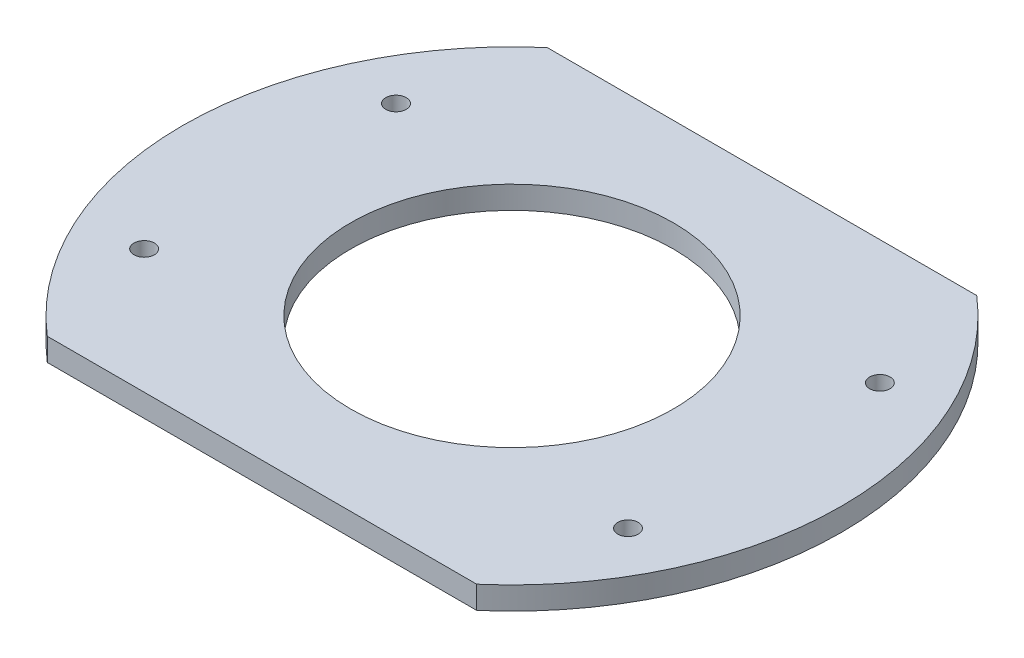
ISO-10303-21;
HEADER;
FILE_DESCRIPTION(('STEP AP214'),'2;1');
FILE_NAME('part.step','',(''),(''),'','','');
FILE_SCHEMA(('AUTOMOTIVE_DESIGN { 1 0 10303 214 1 1 1 1 }'));
ENDSEC;
DATA;
#1=APPLICATION_CONTEXT('core data for automotive mechanical design processes');
#2=APPLICATION_PROTOCOL_DEFINITION('international standard','automotive_design',2000,#1);
#3=PRODUCT_CONTEXT('',#1,'mechanical');
#4=PRODUCT('Part','Part','',(#3));
#5=PRODUCT_RELATED_PRODUCT_CATEGORY('part','',(#4));
#6=PRODUCT_DEFINITION_FORMATION('','',#4);
#7=PRODUCT_DEFINITION_CONTEXT('part definition',#1,'design');
#8=PRODUCT_DEFINITION('design','',#6,#7);
#9=PRODUCT_DEFINITION_SHAPE('','',#8);
#10=(LENGTH_UNIT() NAMED_UNIT(*) SI_UNIT(.MILLI.,.METRE.));
#11=(NAMED_UNIT(*) PLANE_ANGLE_UNIT() SI_UNIT($,.RADIAN.));
#12=(NAMED_UNIT(*) SI_UNIT($,.STERADIAN.) SOLID_ANGLE_UNIT());
#13=UNCERTAINTY_MEASURE_WITH_UNIT(LENGTH_MEASURE(1.E-05),#10,'distance_accuracy_value','');
#14=(GEOMETRIC_REPRESENTATION_CONTEXT(3) GLOBAL_UNCERTAINTY_ASSIGNED_CONTEXT((#13)) GLOBAL_UNIT_ASSIGNED_CONTEXT((#10,
#11,#12)) REPRESENTATION_CONTEXT('',''));
#15=CARTESIAN_POINT('',(0.,0.,0.));
#16=DIRECTION('',(0.,0.,1.));
#17=DIRECTION('',(1.,0.,0.));
#18=AXIS2_PLACEMENT_3D('',#15,#16,#17);
#19=CARTESIAN_POINT('',(0.,5.,0.));
#20=DIRECTION('',(0.,1.,0.));
#21=DIRECTION('',(0.,0.,1.));
#22=AXIS2_PLACEMENT_3D('',#19,#20,#21);
#23=PLANE('',#22);
#24=CARTESIAN_POINT('',(-53.2206499906933,5.,27.7049167941021));
#25=DIRECTION('',(0.,1.,0.));
#26=DIRECTION('',(0.,0.,1.));
#27=AXIS2_PLACEMENT_3D('',#24,#25,#26);
#28=CIRCLE('',#27,2.25);
#29=CARTESIAN_POINT('',(-53.2206499906933,5.,29.9549167941021));
#30=VERTEX_POINT('',#29);
#31=EDGE_CURVE('E155',#30,#30,#28,.T.);
#32=ORIENTED_EDGE('',*,*,#31,.F.);
#33=EDGE_LOOP('',(#32));
#34=FACE_BOUND('',#33,.T.);
#35=CARTESIAN_POINT('',(53.2206499906933,5.,-27.7049167941021));
#36=DIRECTION('',(0.,1.,0.));
#37=DIRECTION('',(0.,0.,1.));
#38=AXIS2_PLACEMENT_3D('',#35,#36,#37);
#39=CIRCLE('',#38,2.25);
#40=CARTESIAN_POINT('',(53.2206499906933,5.,-25.4549167941022));
#41=VERTEX_POINT('',#40);
#42=EDGE_CURVE('E139',#41,#41,#39,.T.);
#43=ORIENTED_EDGE('',*,*,#42,.F.);
#44=EDGE_LOOP('',(#43));
#45=FACE_BOUND('',#44,.T.);
#46=CARTESIAN_POINT('',(0.,5.,0.));
#47=DIRECTION('',(0.,1.,0.));
#48=DIRECTION('',(0.,0.,1.));
#49=AXIS2_PLACEMENT_3D('',#46,#47,#48);
#50=CIRCLE('',#49,72.5);
#51=CARTESIAN_POINT('',(-47.236109069228,5.,-55.));
#52=VERTEX_POINT('',#51);
#53=CARTESIAN_POINT('',(-47.236109069228,5.,55.));
#54=VERTEX_POINT('',#53);
#55=EDGE_CURVE('E94',#52,#54,#50,.T.);
#56=ORIENTED_EDGE('',*,*,#55,.T.);
#57=DIRECTION('',(1.,0.,0.));
#58=VECTOR('',#57,1.);
#59=CARTESIAN_POINT('',(-47.236109069228,5.,55.));
#60=LINE('',#59,#58);
#61=CARTESIAN_POINT('',(47.236109069228,5.,55.));
#62=VERTEX_POINT('',#61);
#63=EDGE_CURVE('E89',#54,#62,#60,.T.);
#64=ORIENTED_EDGE('',*,*,#63,.T.);
#65=CARTESIAN_POINT('',(0.,5.,0.));
#66=DIRECTION('',(0.,1.,0.));
#67=DIRECTION('',(0.,0.,1.));
#68=AXIS2_PLACEMENT_3D('',#65,#66,#67);
#69=CIRCLE('',#68,72.5);
#70=CARTESIAN_POINT('',(47.2361090692279,5.,-55.));
#71=VERTEX_POINT('',#70);
#72=EDGE_CURVE('E92',#62,#71,#69,.T.);
#73=ORIENTED_EDGE('',*,*,#72,.T.);
#74=DIRECTION('',(-1.,0.,0.));
#75=VECTOR('',#74,1.);
#76=CARTESIAN_POINT('',(-47.236109069228,5.,-55.));
#77=LINE('',#76,#75);
#78=EDGE_CURVE('E59',#71,#52,#77,.T.);
#79=ORIENTED_EDGE('',*,*,#78,.T.);
#80=EDGE_LOOP('',(#56,#64,#73,#79));
#81=FACE_BOUND('',#80,.T.);
#82=CARTESIAN_POINT('',(0.,5.,0.));
#83=DIRECTION('',(0.,1.,0.));
#84=DIRECTION('',(0.,0.,1.));
#85=AXIS2_PLACEMENT_3D('',#82,#83,#84);
#86=CIRCLE('',#85,35.5);
#87=CARTESIAN_POINT('',(0.,5.,35.5));
#88=VERTEX_POINT('',#87);
#89=EDGE_CURVE('E115',#88,#88,#86,.T.);
#90=ORIENTED_EDGE('',*,*,#89,.F.);
#91=EDGE_LOOP('',(#90));
#92=FACE_BOUND('',#91,.T.);
#93=CARTESIAN_POINT('',(53.2206499906933,5.,27.7049167941021));
#94=DIRECTION('',(0.,1.,0.));
#95=DIRECTION('',(0.,0.,1.));
#96=AXIS2_PLACEMENT_3D('',#93,#94,#95);
#97=CIRCLE('',#96,2.25);
#98=CARTESIAN_POINT('',(53.2206499906933,5.,29.9549167941021));
#99=VERTEX_POINT('',#98);
#100=EDGE_CURVE('E147',#99,#99,#97,.T.);
#101=ORIENTED_EDGE('',*,*,#100,.F.);
#102=EDGE_LOOP('',(#101));
#103=FACE_BOUND('',#102,.T.);
#104=CARTESIAN_POINT('',(-53.2206499906933,5.,-27.7049167941021));
#105=DIRECTION('',(0.,1.,0.));
#106=DIRECTION('',(0.,0.,1.));
#107=AXIS2_PLACEMENT_3D('',#104,#105,#106);
#108=CIRCLE('',#107,2.25);
#109=CARTESIAN_POINT('',(-53.2206499906933,5.,-25.4549167941021));
#110=VERTEX_POINT('',#109);
#111=EDGE_CURVE('E163',#110,#110,#108,.T.);
#112=ORIENTED_EDGE('',*,*,#111,.F.);
#113=EDGE_LOOP('',(#112));
#114=FACE_BOUND('',#113,.T.);
#115=ADVANCED_FACE('F41',(#34,#45,#81,#92,#103,#114),#23,.T.);
#116=CARTESIAN_POINT('',(0.,0.,0.));
#117=DIRECTION('',(0.,1.,0.));
#118=DIRECTION('',(0.,0.,1.));
#119=AXIS2_PLACEMENT_3D('',#116,#117,#118);
#120=PLANE('',#119);
#121=CARTESIAN_POINT('',(0.,0.,0.));
#122=DIRECTION('',(0.,1.,0.));
#123=DIRECTION('',(0.,0.,1.));
#124=AXIS2_PLACEMENT_3D('',#121,#122,#123);
#125=CIRCLE('',#124,72.5);
#126=CARTESIAN_POINT('',(-47.236109069228,0.,-55.));
#127=VERTEX_POINT('',#126);
#128=CARTESIAN_POINT('',(-47.236109069228,0.,55.));
#129=VERTEX_POINT('',#128);
#130=EDGE_CURVE('E111',#127,#129,#125,.T.);
#131=ORIENTED_EDGE('',*,*,#130,.F.);
#132=DIRECTION('',(-1.,0.,0.));
#133=VECTOR('',#132,1.);
#134=CARTESIAN_POINT('',(-47.236109069228,0.,-55.));
#135=LINE('',#134,#133);
#136=CARTESIAN_POINT('',(47.2361090692279,0.,-55.));
#137=VERTEX_POINT('',#136);
#138=EDGE_CURVE('E82',#137,#127,#135,.T.);
#139=ORIENTED_EDGE('',*,*,#138,.F.);
#140=CARTESIAN_POINT('',(0.,0.,0.));
#141=DIRECTION('',(0.,1.,0.));
#142=DIRECTION('',(0.,0.,1.));
#143=AXIS2_PLACEMENT_3D('',#140,#141,#142);
#144=CIRCLE('',#143,72.5);
#145=CARTESIAN_POINT('',(47.236109069228,0.,55.));
#146=VERTEX_POINT('',#145);
#147=EDGE_CURVE('E76',#146,#137,#144,.T.);
#148=ORIENTED_EDGE('',*,*,#147,.F.);
#149=DIRECTION('',(1.,0.,0.));
#150=VECTOR('',#149,1.);
#151=CARTESIAN_POINT('',(-47.236109069228,0.,55.));
#152=LINE('',#151,#150);
#153=EDGE_CURVE('E99',#129,#146,#152,.T.);
#154=ORIENTED_EDGE('',*,*,#153,.F.);
#155=EDGE_LOOP('',(#131,#139,#148,#154));
#156=FACE_BOUND('',#155,.T.);
#157=CARTESIAN_POINT('',(0.,0.,0.));
#158=DIRECTION('',(0.,1.,0.));
#159=DIRECTION('',(0.,0.,1.));
#160=AXIS2_PLACEMENT_3D('',#157,#158,#159);
#161=CIRCLE('',#160,35.5);
#162=CARTESIAN_POINT('',(0.,0.,35.5));
#163=VERTEX_POINT('',#162);
#164=EDGE_CURVE('E135',#163,#163,#161,.T.);
#165=ORIENTED_EDGE('',*,*,#164,.T.);
#166=EDGE_LOOP('',(#165));
#167=FACE_BOUND('',#166,.T.);
#168=CARTESIAN_POINT('',(53.2206499906933,0.,-27.7049167941021));
#169=DIRECTION('',(0.,1.,0.));
#170=DIRECTION('',(0.,0.,1.));
#171=AXIS2_PLACEMENT_3D('',#168,#169,#170);
#172=CIRCLE('',#171,2.25);
#173=CARTESIAN_POINT('',(53.2206499906933,0.,-25.4549167941022));
#174=VERTEX_POINT('',#173);
#175=EDGE_CURVE('E143',#174,#174,#172,.T.);
#176=ORIENTED_EDGE('',*,*,#175,.T.);
#177=EDGE_LOOP('',(#176));
#178=FACE_BOUND('',#177,.T.);
#179=CARTESIAN_POINT('',(53.2206499906933,0.,27.7049167941021));
#180=DIRECTION('',(0.,1.,0.));
#181=DIRECTION('',(0.,0.,1.));
#182=AXIS2_PLACEMENT_3D('',#179,#180,#181);
#183=CIRCLE('',#182,2.25);
#184=CARTESIAN_POINT('',(53.2206499906933,0.,29.9549167941021));
#185=VERTEX_POINT('',#184);
#186=EDGE_CURVE('E151',#185,#185,#183,.T.);
#187=ORIENTED_EDGE('',*,*,#186,.T.);
#188=EDGE_LOOP('',(#187));
#189=FACE_BOUND('',#188,.T.);
#190=CARTESIAN_POINT('',(-53.2206499906933,0.,27.7049167941021));
#191=DIRECTION('',(0.,1.,0.));
#192=DIRECTION('',(0.,0.,1.));
#193=AXIS2_PLACEMENT_3D('',#190,#191,#192);
#194=CIRCLE('',#193,2.25);
#195=CARTESIAN_POINT('',(-53.2206499906933,0.,29.9549167941021));
#196=VERTEX_POINT('',#195);
#197=EDGE_CURVE('E159',#196,#196,#194,.T.);
#198=ORIENTED_EDGE('',*,*,#197,.T.);
#199=EDGE_LOOP('',(#198));
#200=FACE_BOUND('',#199,.T.);
#201=CARTESIAN_POINT('',(-53.2206499906933,0.,-27.7049167941021));
#202=DIRECTION('',(0.,1.,0.));
#203=DIRECTION('',(0.,0.,1.));
#204=AXIS2_PLACEMENT_3D('',#201,#202,#203);
#205=CIRCLE('',#204,2.25);
#206=CARTESIAN_POINT('',(-53.2206499906933,0.,-25.4549167941021));
#207=VERTEX_POINT('',#206);
#208=EDGE_CURVE('E167',#207,#207,#205,.T.);
#209=ORIENTED_EDGE('',*,*,#208,.T.);
#210=EDGE_LOOP('',(#209));
#211=FACE_BOUND('',#210,.T.);
#212=ADVANCED_FACE('F129',(#156,#167,#178,#189,#200,#211),#120,.F.);
#213=CARTESIAN_POINT('',(0.,5.,0.));
#214=DIRECTION('',(0.,-1.,0.));
#215=DIRECTION('',(0.,0.,-1.));
#216=AXIS2_PLACEMENT_3D('',#213,#214,#215);
#217=CYLINDRICAL_SURFACE('',#216,72.5);
#218=ORIENTED_EDGE('',*,*,#130,.T.);
#219=DIRECTION('',(0.,-1.,0.));
#220=VECTOR('',#219,1.);
#221=CARTESIAN_POINT('',(-47.236109069228,5.,55.));
#222=LINE('',#221,#220);
#223=EDGE_CURVE('E11',#54,#129,#222,.T.);
#224=ORIENTED_EDGE('',*,*,#223,.F.);
#225=ORIENTED_EDGE('',*,*,#55,.F.);
#226=DIRECTION('',(0.,-1.,0.));
#227=VECTOR('',#226,1.);
#228=CARTESIAN_POINT('',(-47.236109069228,5.,-55.));
#229=LINE('',#228,#227);
#230=EDGE_CURVE('E107',#52,#127,#229,.T.);
#231=ORIENTED_EDGE('',*,*,#230,.T.);
#232=EDGE_LOOP('',(#218,#224,#225,#231));
#233=FACE_BOUND('',#232,.T.);
#234=ADVANCED_FACE('F43',(#233),#217,.T.);
#235=CARTESIAN_POINT('',(-47.236109069228,5.,55.));
#236=DIRECTION('',(0.,0.,-1.));
#237=DIRECTION('',(-1.,0.,0.));
#238=AXIS2_PLACEMENT_3D('',#235,#236,#237);
#239=PLANE('',#238);
#240=ORIENTED_EDGE('',*,*,#153,.T.);
#241=DIRECTION('',(0.,-1.,0.));
#242=VECTOR('',#241,1.);
#243=CARTESIAN_POINT('',(47.236109069228,5.,55.));
#244=LINE('',#243,#242);
#245=EDGE_CURVE('E51',#62,#146,#244,.T.);
#246=ORIENTED_EDGE('',*,*,#245,.F.);
#247=ORIENTED_EDGE('',*,*,#63,.F.);
#248=ORIENTED_EDGE('',*,*,#223,.T.);
#249=EDGE_LOOP('',(#240,#246,#247,#248));
#250=FACE_BOUND('',#249,.T.);
#251=ADVANCED_FACE('F98',(#250),#239,.F.);
#252=CARTESIAN_POINT('',(0.,5.,0.));
#253=DIRECTION('',(0.,-1.,0.));
#254=DIRECTION('',(0.,0.,-1.));
#255=AXIS2_PLACEMENT_3D('',#252,#253,#254);
#256=CYLINDRICAL_SURFACE('',#255,72.5);
#257=ORIENTED_EDGE('',*,*,#147,.T.);
#258=DIRECTION('',(0.,-1.,0.));
#259=VECTOR('',#258,1.);
#260=CARTESIAN_POINT('',(47.2361090692279,5.,-55.));
#261=LINE('',#260,#259);
#262=EDGE_CURVE('E101',#71,#137,#261,.T.);
#263=ORIENTED_EDGE('',*,*,#262,.F.);
#264=ORIENTED_EDGE('',*,*,#72,.F.);
#265=ORIENTED_EDGE('',*,*,#245,.T.);
#266=EDGE_LOOP('',(#257,#263,#264,#265));
#267=FACE_BOUND('',#266,.T.);
#268=ADVANCED_FACE('F102',(#267),#256,.T.);
#269=CARTESIAN_POINT('',(-47.236109069228,5.,-55.));
#270=DIRECTION('',(0.,0.,1.));
#271=DIRECTION('',(1.,0.,0.));
#272=AXIS2_PLACEMENT_3D('',#269,#270,#271);
#273=PLANE('',#272);
#274=ORIENTED_EDGE('',*,*,#138,.T.);
#275=ORIENTED_EDGE('',*,*,#230,.F.);
#276=ORIENTED_EDGE('',*,*,#78,.F.);
#277=ORIENTED_EDGE('',*,*,#262,.T.);
#278=EDGE_LOOP('',(#274,#275,#276,#277));
#279=FACE_BOUND('',#278,.T.);
#280=ADVANCED_FACE('F126',(#279),#273,.F.);
#281=CARTESIAN_POINT('',(0.,5.,0.));
#282=DIRECTION('',(0.,-1.,0.));
#283=DIRECTION('',(0.,0.,-1.));
#284=AXIS2_PLACEMENT_3D('',#281,#282,#283);
#285=CYLINDRICAL_SURFACE('',#284,35.5);
#286=ORIENTED_EDGE('',*,*,#89,.T.);
#287=EDGE_LOOP('',(#286));
#288=FACE_BOUND('',#287,.T.);
#289=ORIENTED_EDGE('',*,*,#164,.F.);
#290=EDGE_LOOP('',(#289));
#291=FACE_BOUND('',#290,.T.);
#292=ADVANCED_FACE('F189',(#288,#291),#285,.F.);
#293=CARTESIAN_POINT('',(53.2206499906933,5.,-27.7049167941021));
#294=DIRECTION('',(0.,-1.,0.));
#295=DIRECTION('',(0.,0.,-1.));
#296=AXIS2_PLACEMENT_3D('',#293,#294,#295);
#297=CYLINDRICAL_SURFACE('',#296,2.25);
#298=ORIENTED_EDGE('',*,*,#42,.T.);
#299=EDGE_LOOP('',(#298));
#300=FACE_BOUND('',#299,.T.);
#301=ORIENTED_EDGE('',*,*,#175,.F.);
#302=EDGE_LOOP('',(#301));
#303=FACE_BOUND('',#302,.T.);
#304=ADVANCED_FACE('F243',(#300,#303),#297,.F.);
#305=CARTESIAN_POINT('',(53.2206499906933,5.,27.7049167941021));
#306=DIRECTION('',(0.,-1.,0.));
#307=DIRECTION('',(0.,0.,-1.));
#308=AXIS2_PLACEMENT_3D('',#305,#306,#307);
#309=CYLINDRICAL_SURFACE('',#308,2.25);
#310=ORIENTED_EDGE('',*,*,#100,.T.);
#311=EDGE_LOOP('',(#310));
#312=FACE_BOUND('',#311,.T.);
#313=ORIENTED_EDGE('',*,*,#186,.F.);
#314=EDGE_LOOP('',(#313));
#315=FACE_BOUND('',#314,.T.);
#316=ADVANCED_FACE('F252',(#312,#315),#309,.F.);
#317=CARTESIAN_POINT('',(-53.2206499906933,5.,27.7049167941021));
#318=DIRECTION('',(0.,-1.,0.));
#319=DIRECTION('',(0.,0.,-1.));
#320=AXIS2_PLACEMENT_3D('',#317,#318,#319);
#321=CYLINDRICAL_SURFACE('',#320,2.25);
#322=ORIENTED_EDGE('',*,*,#31,.T.);
#323=EDGE_LOOP('',(#322));
#324=FACE_BOUND('',#323,.T.);
#325=ORIENTED_EDGE('',*,*,#197,.F.);
#326=EDGE_LOOP('',(#325));
#327=FACE_BOUND('',#326,.T.);
#328=ADVANCED_FACE('F261',(#324,#327),#321,.F.);
#329=CARTESIAN_POINT('',(-53.2206499906933,5.,-27.7049167941021));
#330=DIRECTION('',(0.,-1.,0.));
#331=DIRECTION('',(0.,0.,-1.));
#332=AXIS2_PLACEMENT_3D('',#329,#330,#331);
#333=CYLINDRICAL_SURFACE('',#332,2.25);
#334=ORIENTED_EDGE('',*,*,#111,.T.);
#335=EDGE_LOOP('',(#334));
#336=FACE_BOUND('',#335,.T.);
#337=ORIENTED_EDGE('',*,*,#208,.F.);
#338=EDGE_LOOP('',(#337));
#339=FACE_BOUND('',#338,.T.);
#340=ADVANCED_FACE('F176',(#336,#339),#333,.F.);
#341=CLOSED_SHELL('',(#115,#212,#234,#251,#268,#280,#292,#304,#316,#328,#340));
#342=MANIFOLD_SOLID_BREP('B2',#341);
#343=ADVANCED_BREP_SHAPE_REPRESENTATION('',(#18,#342),#14);
#344=SHAPE_DEFINITION_REPRESENTATION(#9,#343);
ENDSEC;
END-ISO-10303-21;
